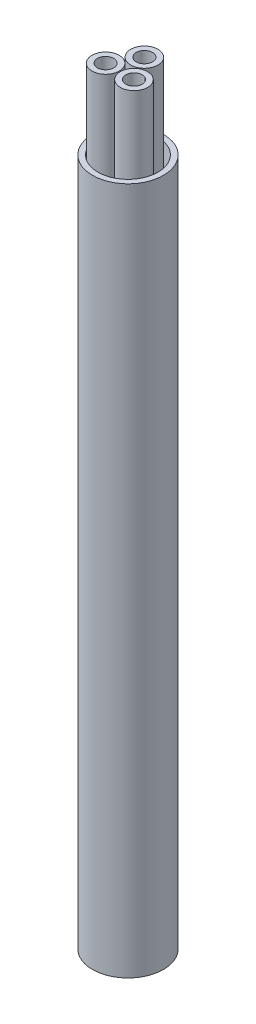
ISO-10303-21;
HEADER;
FILE_DESCRIPTION(('STEP AP214'),'2;1');
FILE_NAME('part.step','',(''),(''),'','','');
FILE_SCHEMA(('AUTOMOTIVE_DESIGN { 1 0 10303 214 1 1 1 1 }'));
ENDSEC;
DATA;
#1=APPLICATION_CONTEXT('core data for automotive mechanical design processes');
#2=APPLICATION_PROTOCOL_DEFINITION('international standard','automotive_design',2000,#1);
#3=PRODUCT_CONTEXT('',#1,'mechanical');
#4=PRODUCT('Part','Part','',(#3));
#5=PRODUCT_RELATED_PRODUCT_CATEGORY('part','',(#4));
#6=PRODUCT_DEFINITION_FORMATION('','',#4);
#7=PRODUCT_DEFINITION_CONTEXT('part definition',#1,'design');
#8=PRODUCT_DEFINITION('design','',#6,#7);
#9=PRODUCT_DEFINITION_SHAPE('','',#8);
#10=(LENGTH_UNIT() NAMED_UNIT(*) SI_UNIT(.MILLI.,.METRE.));
#11=(NAMED_UNIT(*) PLANE_ANGLE_UNIT() SI_UNIT($,.RADIAN.));
#12=(NAMED_UNIT(*) SI_UNIT($,.STERADIAN.) SOLID_ANGLE_UNIT());
#13=UNCERTAINTY_MEASURE_WITH_UNIT(LENGTH_MEASURE(1.E-05),#10,'distance_accuracy_value','');
#14=(GEOMETRIC_REPRESENTATION_CONTEXT(3) GLOBAL_UNCERTAINTY_ASSIGNED_CONTEXT((#13)) GLOBAL_UNIT_ASSIGNED_CONTEXT((#10,
#11,#12)) REPRESENTATION_CONTEXT('',''));
#15=CARTESIAN_POINT('',(0.,0.,0.));
#16=DIRECTION('',(0.,0.,1.));
#17=DIRECTION('',(1.,0.,0.));
#18=AXIS2_PLACEMENT_3D('',#15,#16,#17);
#19=CARTESIAN_POINT('',(0.,63.,0.));
#20=DIRECTION('',(0.,-1.,0.));
#21=DIRECTION('',(0.,0.,-1.));
#22=AXIS2_PLACEMENT_3D('',#19,#20,#21);
#23=CYLINDRICAL_SURFACE('',#22,2.75111069989303);
#24=CARTESIAN_POINT('',(0.,63.,0.));
#25=DIRECTION('',(0.,1.,0.));
#26=DIRECTION('',(0.,0.,1.));
#27=AXIS2_PLACEMENT_3D('',#24,#25,#26);
#28=CIRCLE('',#27,2.75111069989303);
#29=CARTESIAN_POINT('',(0.,63.,2.75111069989303));
#30=VERTEX_POINT('',#29);
#31=EDGE_CURVE('E70',#30,#30,#28,.T.);
#32=ORIENTED_EDGE('',*,*,#31,.T.);
#33=EDGE_LOOP('',(#32));
#34=FACE_BOUND('',#33,.T.);
#35=CARTESIAN_POINT('',(0.,0.,0.));
#36=DIRECTION('',(0.,1.,0.));
#37=DIRECTION('',(0.,0.,1.));
#38=AXIS2_PLACEMENT_3D('',#35,#36,#37);
#39=CIRCLE('',#38,2.75111069989303);
#40=CARTESIAN_POINT('',(0.,0.,2.75111069989303));
#41=VERTEX_POINT('',#40);
#42=EDGE_CURVE('E77',#41,#41,#39,.T.);
#43=ORIENTED_EDGE('',*,*,#42,.F.);
#44=EDGE_LOOP('',(#43));
#45=FACE_BOUND('',#44,.T.);
#46=ADVANCED_FACE('F62',(#34,#45),#23,.F.);
#47=CARTESIAN_POINT('',(0.,63.,0.));
#48=DIRECTION('',(0.,-1.,0.));
#49=DIRECTION('',(0.,0.,-1.));
#50=AXIS2_PLACEMENT_3D('',#47,#48,#49);
#51=CYLINDRICAL_SURFACE('',#50,3.25111069989303);
#52=CARTESIAN_POINT('',(0.,63.,0.));
#53=DIRECTION('',(0.,1.,0.));
#54=DIRECTION('',(0.,0.,1.));
#55=AXIS2_PLACEMENT_3D('',#52,#53,#54);
#56=CIRCLE('',#55,3.25111069989303);
#57=CARTESIAN_POINT('',(0.,63.,3.25111069989303));
#58=VERTEX_POINT('',#57);
#59=EDGE_CURVE('E12',#58,#58,#56,.T.);
#60=ORIENTED_EDGE('',*,*,#59,.F.);
#61=EDGE_LOOP('',(#60));
#62=FACE_BOUND('',#61,.T.);
#63=CARTESIAN_POINT('',(0.,0.,0.));
#64=DIRECTION('',(0.,1.,0.));
#65=DIRECTION('',(0.,0.,1.));
#66=AXIS2_PLACEMENT_3D('',#63,#64,#65);
#67=CIRCLE('',#66,3.25111069989303);
#68=CARTESIAN_POINT('',(0.,0.,3.25111069989303));
#69=VERTEX_POINT('',#68);
#70=EDGE_CURVE('E65',#69,#69,#67,.T.);
#71=ORIENTED_EDGE('',*,*,#70,.T.);
#72=EDGE_LOOP('',(#71));
#73=FACE_BOUND('',#72,.T.);
#74=ADVANCED_FACE('F86',(#62,#73),#51,.T.);
#75=CARTESIAN_POINT('',(0.,63.,0.));
#76=DIRECTION('',(0.,1.,0.));
#77=DIRECTION('',(0.,0.,1.));
#78=AXIS2_PLACEMENT_3D('',#75,#76,#77);
#79=PLANE('',#78);
#80=ORIENTED_EDGE('',*,*,#31,.F.);
#81=EDGE_LOOP('',(#80));
#82=FACE_BOUND('',#81,.T.);
#83=ORIENTED_EDGE('',*,*,#59,.T.);
#84=EDGE_LOOP('',(#83));
#85=FACE_BOUND('',#84,.T.);
#86=ADVANCED_FACE('F90',(#82,#85),#79,.T.);
#87=CARTESIAN_POINT('',(0.,0.,0.));
#88=DIRECTION('',(0.,1.,0.));
#89=DIRECTION('',(0.,0.,1.));
#90=AXIS2_PLACEMENT_3D('',#87,#88,#89);
#91=PLANE('',#90);
#92=ORIENTED_EDGE('',*,*,#42,.T.);
#93=EDGE_LOOP('',(#92));
#94=FACE_BOUND('',#93,.T.);
#95=ORIENTED_EDGE('',*,*,#70,.F.);
#96=EDGE_LOOP('',(#95));
#97=FACE_BOUND('',#96,.T.);
#98=ADVANCED_FACE('F88',(#94,#97),#91,.F.);
#99=CLOSED_SHELL('',(#46,#74,#86,#98));
#100=MANIFOLD_SOLID_BREP('B2',#99);
#101=CARTESIAN_POINT('',(1.3,70.,0.750555349946514));
#102=DIRECTION('',(0.,-1.,0.));
#103=DIRECTION('',(0.,0.,-1.));
#104=AXIS2_PLACEMENT_3D('',#101,#102,#103);
#105=CYLINDRICAL_SURFACE('',#104,0.749999999999999);
#106=CARTESIAN_POINT('',(1.3,70.,0.750555349946514));
#107=DIRECTION('',(0.,1.,0.));
#108=DIRECTION('',(0.,0.,1.));
#109=AXIS2_PLACEMENT_3D('',#106,#107,#108);
#110=CIRCLE('',#109,0.749999999999999);
#111=CARTESIAN_POINT('',(1.3,70.,1.50055534994651));
#112=VERTEX_POINT('',#111);
#113=EDGE_CURVE('E151',#112,#112,#110,.T.);
#114=ORIENTED_EDGE('',*,*,#113,.T.);
#115=EDGE_LOOP('',(#114));
#116=FACE_BOUND('',#115,.T.);
#117=CARTESIAN_POINT('',(1.3,0.,0.750555349946514));
#118=DIRECTION('',(0.,1.,0.));
#119=DIRECTION('',(0.,0.,1.));
#120=AXIS2_PLACEMENT_3D('',#117,#118,#119);
#121=CIRCLE('',#120,0.749999999999999);
#122=CARTESIAN_POINT('',(1.3,0.,1.50055534994651));
#123=VERTEX_POINT('',#122);
#124=EDGE_CURVE('E157',#123,#123,#121,.T.);
#125=ORIENTED_EDGE('',*,*,#124,.F.);
#126=EDGE_LOOP('',(#125));
#127=FACE_BOUND('',#126,.T.);
#128=ADVANCED_FACE('F144',(#116,#127),#105,.F.);
#129=CARTESIAN_POINT('',(1.3,70.,0.750555349946514));
#130=DIRECTION('',(0.,-1.,0.));
#131=DIRECTION('',(0.,0.,-1.));
#132=AXIS2_PLACEMENT_3D('',#129,#130,#131);
#133=CYLINDRICAL_SURFACE('',#132,1.25);
#134=CARTESIAN_POINT('',(1.3,70.,0.750555349946514));
#135=DIRECTION('',(0.,1.,0.));
#136=DIRECTION('',(0.,0.,1.));
#137=AXIS2_PLACEMENT_3D('',#134,#135,#136);
#138=CIRCLE('',#137,1.25);
#139=CARTESIAN_POINT('',(1.3,70.,2.00055534994651));
#140=VERTEX_POINT('',#139);
#141=EDGE_CURVE('E61',#140,#140,#138,.T.);
#142=ORIENTED_EDGE('',*,*,#141,.F.);
#143=EDGE_LOOP('',(#142));
#144=FACE_BOUND('',#143,.T.);
#145=CARTESIAN_POINT('',(1.3,0.,0.750555349946514));
#146=DIRECTION('',(0.,1.,0.));
#147=DIRECTION('',(0.,0.,1.));
#148=AXIS2_PLACEMENT_3D('',#145,#146,#147);
#149=CIRCLE('',#148,1.25);
#150=CARTESIAN_POINT('',(1.3,0.,2.00055534994651));
#151=VERTEX_POINT('',#150);
#152=EDGE_CURVE('E147',#151,#151,#149,.T.);
#153=ORIENTED_EDGE('',*,*,#152,.T.);
#154=EDGE_LOOP('',(#153));
#155=FACE_BOUND('',#154,.T.);
#156=ADVANCED_FACE('F164',(#144,#155),#133,.T.);
#157=CARTESIAN_POINT('',(0.,70.,0.));
#158=DIRECTION('',(0.,1.,0.));
#159=DIRECTION('',(0.,0.,1.));
#160=AXIS2_PLACEMENT_3D('',#157,#158,#159);
#161=PLANE('',#160);
#162=ORIENTED_EDGE('',*,*,#113,.F.);
#163=EDGE_LOOP('',(#162));
#164=FACE_BOUND('',#163,.T.);
#165=ORIENTED_EDGE('',*,*,#141,.T.);
#166=EDGE_LOOP('',(#165));
#167=FACE_BOUND('',#166,.T.);
#168=ADVANCED_FACE('F168',(#164,#167),#161,.T.);
#169=CARTESIAN_POINT('',(0.,0.,0.));
#170=DIRECTION('',(0.,1.,0.));
#171=DIRECTION('',(0.,0.,1.));
#172=AXIS2_PLACEMENT_3D('',#169,#170,#171);
#173=PLANE('',#172);
#174=ORIENTED_EDGE('',*,*,#124,.T.);
#175=EDGE_LOOP('',(#174));
#176=FACE_BOUND('',#175,.T.);
#177=ORIENTED_EDGE('',*,*,#152,.F.);
#178=EDGE_LOOP('',(#177));
#179=FACE_BOUND('',#178,.T.);
#180=ADVANCED_FACE('F166',(#176,#179),#173,.F.);
#181=CLOSED_SHELL('',(#128,#156,#168,#180));
#182=MANIFOLD_SOLID_BREP('B7',#181);
#183=CARTESIAN_POINT('',(0.,70.,-1.50111069989303));
#184=DIRECTION('',(0.,-1.,0.));
#185=DIRECTION('',(0.,0.,-1.));
#186=AXIS2_PLACEMENT_3D('',#183,#184,#185);
#187=CYLINDRICAL_SURFACE('',#186,0.750000000000001);
#188=CARTESIAN_POINT('',(0.,70.,-1.50111069989303));
#189=DIRECTION('',(0.,1.,0.));
#190=DIRECTION('',(0.,0.,1.));
#191=AXIS2_PLACEMENT_3D('',#188,#189,#190);
#192=CIRCLE('',#191,0.750000000000001);
#193=CARTESIAN_POINT('',(0.,70.,-0.751110699893026));
#194=VERTEX_POINT('',#193);
#195=EDGE_CURVE('E228',#194,#194,#192,.T.);
#196=ORIENTED_EDGE('',*,*,#195,.T.);
#197=EDGE_LOOP('',(#196));
#198=FACE_BOUND('',#197,.T.);
#199=CARTESIAN_POINT('',(0.,0.,-1.50111069989303));
#200=DIRECTION('',(0.,1.,0.));
#201=DIRECTION('',(0.,0.,1.));
#202=AXIS2_PLACEMENT_3D('',#199,#200,#201);
#203=CIRCLE('',#202,0.750000000000001);
#204=CARTESIAN_POINT('',(0.,0.,-0.751110699893026));
#205=VERTEX_POINT('',#204);
#206=EDGE_CURVE('E234',#205,#205,#203,.T.);
#207=ORIENTED_EDGE('',*,*,#206,.F.);
#208=EDGE_LOOP('',(#207));
#209=FACE_BOUND('',#208,.T.);
#210=ADVANCED_FACE('F221',(#198,#209),#187,.F.);
#211=CARTESIAN_POINT('',(0.,70.,-1.50111069989303));
#212=DIRECTION('',(0.,-1.,0.));
#213=DIRECTION('',(0.,0.,-1.));
#214=AXIS2_PLACEMENT_3D('',#211,#212,#213);
#215=CYLINDRICAL_SURFACE('',#214,1.25);
#216=CARTESIAN_POINT('',(0.,70.,-1.50111069989303));
#217=DIRECTION('',(0.,1.,0.));
#218=DIRECTION('',(0.,0.,1.));
#219=AXIS2_PLACEMENT_3D('',#216,#217,#218);
#220=CIRCLE('',#219,1.25);
#221=CARTESIAN_POINT('',(0.,70.,-0.251110699893026));
#222=VERTEX_POINT('',#221);
#223=EDGE_CURVE('E143',#222,#222,#220,.T.);
#224=ORIENTED_EDGE('',*,*,#223,.F.);
#225=EDGE_LOOP('',(#224));
#226=FACE_BOUND('',#225,.T.);
#227=CARTESIAN_POINT('',(0.,0.,-1.50111069989303));
#228=DIRECTION('',(0.,1.,0.));
#229=DIRECTION('',(0.,0.,1.));
#230=AXIS2_PLACEMENT_3D('',#227,#228,#229);
#231=CIRCLE('',#230,1.25);
#232=CARTESIAN_POINT('',(0.,0.,-0.251110699893026));
#233=VERTEX_POINT('',#232);
#234=EDGE_CURVE('E224',#233,#233,#231,.T.);
#235=ORIENTED_EDGE('',*,*,#234,.T.);
#236=EDGE_LOOP('',(#235));
#237=FACE_BOUND('',#236,.T.);
#238=ADVANCED_FACE('F241',(#226,#237),#215,.T.);
#239=CARTESIAN_POINT('',(0.,70.,0.));
#240=DIRECTION('',(0.,1.,0.));
#241=DIRECTION('',(0.,0.,1.));
#242=AXIS2_PLACEMENT_3D('',#239,#240,#241);
#243=PLANE('',#242);
#244=ORIENTED_EDGE('',*,*,#195,.F.);
#245=EDGE_LOOP('',(#244));
#246=FACE_BOUND('',#245,.T.);
#247=ORIENTED_EDGE('',*,*,#223,.T.);
#248=EDGE_LOOP('',(#247));
#249=FACE_BOUND('',#248,.T.);
#250=ADVANCED_FACE('F245',(#246,#249),#243,.T.);
#251=CARTESIAN_POINT('',(0.,0.,0.));
#252=DIRECTION('',(0.,1.,0.));
#253=DIRECTION('',(0.,0.,1.));
#254=AXIS2_PLACEMENT_3D('',#251,#252,#253);
#255=PLANE('',#254);
#256=ORIENTED_EDGE('',*,*,#206,.T.);
#257=EDGE_LOOP('',(#256));
#258=FACE_BOUND('',#257,.T.);
#259=ORIENTED_EDGE('',*,*,#234,.F.);
#260=EDGE_LOOP('',(#259));
#261=FACE_BOUND('',#260,.T.);
#262=ADVANCED_FACE('F243',(#258,#261),#255,.F.);
#263=CLOSED_SHELL('',(#210,#238,#250,#262));
#264=MANIFOLD_SOLID_BREP('B56',#263);
#265=CARTESIAN_POINT('',(-1.3,70.,0.750555349946514));
#266=DIRECTION('',(0.,-1.,0.));
#267=DIRECTION('',(0.,0.,-1.));
#268=AXIS2_PLACEMENT_3D('',#265,#266,#267);
#269=CYLINDRICAL_SURFACE('',#268,0.75);
#270=CARTESIAN_POINT('',(-1.3,70.,0.750555349946514));
#271=DIRECTION('',(0.,1.,0.));
#272=DIRECTION('',(0.,0.,1.));
#273=AXIS2_PLACEMENT_3D('',#270,#271,#272);
#274=CIRCLE('',#273,0.75);
#275=CARTESIAN_POINT('',(-1.3,70.,1.50055534994651));
#276=VERTEX_POINT('',#275);
#277=EDGE_CURVE('E298',#276,#276,#274,.T.);
#278=ORIENTED_EDGE('',*,*,#277,.T.);
#279=EDGE_LOOP('',(#278));
#280=FACE_BOUND('',#279,.T.);
#281=CARTESIAN_POINT('',(-1.3,0.,0.750555349946514));
#282=DIRECTION('',(0.,1.,0.));
#283=DIRECTION('',(0.,0.,1.));
#284=AXIS2_PLACEMENT_3D('',#281,#282,#283);
#285=CIRCLE('',#284,0.75);
#286=CARTESIAN_POINT('',(-1.3,0.,1.50055534994651));
#287=VERTEX_POINT('',#286);
#288=EDGE_CURVE('E304',#287,#287,#285,.T.);
#289=ORIENTED_EDGE('',*,*,#288,.F.);
#290=EDGE_LOOP('',(#289));
#291=FACE_BOUND('',#290,.T.);
#292=ADVANCED_FACE('F291',(#280,#291),#269,.F.);
#293=CARTESIAN_POINT('',(-1.3,70.,0.750555349946514));
#294=DIRECTION('',(0.,-1.,0.));
#295=DIRECTION('',(0.,0.,-1.));
#296=AXIS2_PLACEMENT_3D('',#293,#294,#295);
#297=CYLINDRICAL_SURFACE('',#296,1.25);
#298=CARTESIAN_POINT('',(-1.3,70.,0.750555349946514));
#299=DIRECTION('',(0.,1.,0.));
#300=DIRECTION('',(0.,0.,1.));
#301=AXIS2_PLACEMENT_3D('',#298,#299,#300);
#302=CIRCLE('',#301,1.25);
#303=CARTESIAN_POINT('',(-1.3,70.,2.00055534994651));
#304=VERTEX_POINT('',#303);
#305=EDGE_CURVE('E220',#304,#304,#302,.T.);
#306=ORIENTED_EDGE('',*,*,#305,.F.);
#307=EDGE_LOOP('',(#306));
#308=FACE_BOUND('',#307,.T.);
#309=CARTESIAN_POINT('',(-1.3,0.,0.750555349946514));
#310=DIRECTION('',(0.,1.,0.));
#311=DIRECTION('',(0.,0.,1.));
#312=AXIS2_PLACEMENT_3D('',#309,#310,#311);
#313=CIRCLE('',#312,1.25);
#314=CARTESIAN_POINT('',(-1.3,0.,2.00055534994651));
#315=VERTEX_POINT('',#314);
#316=EDGE_CURVE('E294',#315,#315,#313,.T.);
#317=ORIENTED_EDGE('',*,*,#316,.T.);
#318=EDGE_LOOP('',(#317));
#319=FACE_BOUND('',#318,.T.);
#320=ADVANCED_FACE('F311',(#308,#319),#297,.T.);
#321=CARTESIAN_POINT('',(0.,70.,0.));
#322=DIRECTION('',(0.,1.,0.));
#323=DIRECTION('',(0.,0.,1.));
#324=AXIS2_PLACEMENT_3D('',#321,#322,#323);
#325=PLANE('',#324);
#326=ORIENTED_EDGE('',*,*,#277,.F.);
#327=EDGE_LOOP('',(#326));
#328=FACE_BOUND('',#327,.T.);
#329=ORIENTED_EDGE('',*,*,#305,.T.);
#330=EDGE_LOOP('',(#329));
#331=FACE_BOUND('',#330,.T.);
#332=ADVANCED_FACE('F315',(#328,#331),#325,.T.);
#333=CARTESIAN_POINT('',(0.,0.,0.));
#334=DIRECTION('',(0.,1.,0.));
#335=DIRECTION('',(0.,0.,1.));
#336=AXIS2_PLACEMENT_3D('',#333,#334,#335);
#337=PLANE('',#336);
#338=ORIENTED_EDGE('',*,*,#288,.T.);
#339=EDGE_LOOP('',(#338));
#340=FACE_BOUND('',#339,.T.);
#341=ORIENTED_EDGE('',*,*,#316,.F.);
#342=EDGE_LOOP('',(#341));
#343=FACE_BOUND('',#342,.T.);
#344=ADVANCED_FACE('F313',(#340,#343),#337,.F.);
#345=CLOSED_SHELL('',(#292,#320,#332,#344));
#346=MANIFOLD_SOLID_BREP('B138',#345);
#347=ADVANCED_BREP_SHAPE_REPRESENTATION('',(#18,#100,#182,#264,#346),#14);
#348=SHAPE_DEFINITION_REPRESENTATION(#9,#347);
ENDSEC;
END-ISO-10303-21;
